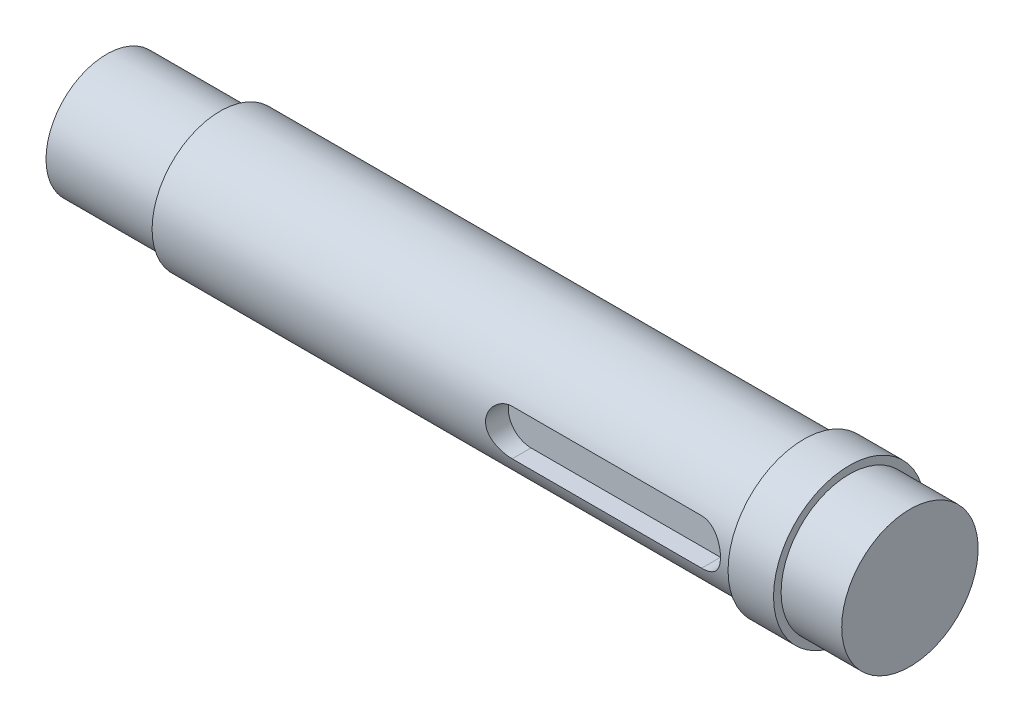
ISO-10303-21;
HEADER;
FILE_DESCRIPTION(('STEP AP214'),'2;1');
FILE_NAME('part.step','',(''),(''),'','','');
FILE_SCHEMA(('AUTOMOTIVE_DESIGN { 1 0 10303 214 1 1 1 1 }'));
ENDSEC;
DATA;
#1=APPLICATION_CONTEXT('core data for automotive mechanical design processes');
#2=APPLICATION_PROTOCOL_DEFINITION('international standard','automotive_design',2000,#1);
#3=PRODUCT_CONTEXT('',#1,'mechanical');
#4=PRODUCT('Part','Part','',(#3));
#5=PRODUCT_RELATED_PRODUCT_CATEGORY('part','',(#4));
#6=PRODUCT_DEFINITION_FORMATION('','',#4);
#7=PRODUCT_DEFINITION_CONTEXT('part definition',#1,'design');
#8=PRODUCT_DEFINITION('design','',#6,#7);
#9=PRODUCT_DEFINITION_SHAPE('','',#8);
#10=(LENGTH_UNIT() NAMED_UNIT(*) SI_UNIT(.MILLI.,.METRE.));
#11=(NAMED_UNIT(*) PLANE_ANGLE_UNIT() SI_UNIT($,.RADIAN.));
#12=(NAMED_UNIT(*) SI_UNIT($,.STERADIAN.) SOLID_ANGLE_UNIT());
#13=UNCERTAINTY_MEASURE_WITH_UNIT(LENGTH_MEASURE(1.E-05),#10,'distance_accuracy_value','');
#14=(GEOMETRIC_REPRESENTATION_CONTEXT(3) GLOBAL_UNCERTAINTY_ASSIGNED_CONTEXT((#13)) GLOBAL_UNIT_ASSIGNED_CONTEXT((#10,
#11,#12)) REPRESENTATION_CONTEXT('',''));
#15=CARTESIAN_POINT('',(0.,0.,0.));
#16=DIRECTION('',(0.,0.,1.));
#17=DIRECTION('',(1.,0.,0.));
#18=AXIS2_PLACEMENT_3D('',#15,#16,#17);
#19=CARTESIAN_POINT('',(0.,0.,0.));
#20=DIRECTION('',(1.,0.,0.));
#21=DIRECTION('',(0.,0.,-1.));
#22=AXIS2_PLACEMENT_3D('',#19,#20,#21);
#23=PLANE('',#22);
#24=CARTESIAN_POINT('',(0.,0.,0.));
#25=DIRECTION('',(-1.,0.,0.));
#26=DIRECTION('',(0.,0.,1.));
#27=AXIS2_PLACEMENT_3D('',#24,#25,#26);
#28=CIRCLE('',#27,8.);
#29=CARTESIAN_POINT('',(0.,0.,8.));
#30=VERTEX_POINT('',#29);
#31=EDGE_CURVE('E127',#30,#30,#28,.T.);
#32=ORIENTED_EDGE('',*,*,#31,.T.);
#33=EDGE_LOOP('',(#32));
#34=FACE_BOUND('',#33,.T.);
#35=ADVANCED_FACE('F38',(#34),#23,.F.);
#36=CARTESIAN_POINT('',(0.,0.,0.));
#37=DIRECTION('',(-1.,0.,0.));
#38=DIRECTION('',(0.,0.,1.));
#39=AXIS2_PLACEMENT_3D('',#36,#37,#38);
#40=CYLINDRICAL_SURFACE('',#39,8.);
#41=ORIENTED_EDGE('',*,*,#31,.F.);
#42=EDGE_LOOP('',(#41));
#43=FACE_BOUND('',#42,.T.);
#44=CARTESIAN_POINT('',(15.,0.,0.));
#45=DIRECTION('',(-1.,0.,0.));
#46=DIRECTION('',(0.,0.,1.));
#47=AXIS2_PLACEMENT_3D('',#44,#45,#46);
#48=CIRCLE('',#47,8.);
#49=CARTESIAN_POINT('',(15.,0.,8.));
#50=VERTEX_POINT('',#49);
#51=EDGE_CURVE('E124',#50,#50,#48,.T.);
#52=ORIENTED_EDGE('',*,*,#51,.T.);
#53=EDGE_LOOP('',(#52));
#54=FACE_BOUND('',#53,.T.);
#55=ADVANCED_FACE('F184',(#43,#54),#40,.T.);
#56=CARTESIAN_POINT('',(15.,0.,-9.));
#57=DIRECTION('',(1.,0.,0.));
#58=DIRECTION('',(0.,0.,-1.));
#59=AXIS2_PLACEMENT_3D('',#56,#57,#58);
#60=PLANE('',#59);
#61=ORIENTED_EDGE('',*,*,#51,.F.);
#62=EDGE_LOOP('',(#61));
#63=FACE_BOUND('',#62,.T.);
#64=CARTESIAN_POINT('',(15.,0.,0.));
#65=DIRECTION('',(-1.,0.,0.));
#66=DIRECTION('',(0.,0.,1.));
#67=AXIS2_PLACEMENT_3D('',#64,#65,#66);
#68=CIRCLE('',#67,9.);
#69=CARTESIAN_POINT('',(15.,0.,9.));
#70=VERTEX_POINT('',#69);
#71=EDGE_CURVE('E121',#70,#70,#68,.T.);
#72=ORIENTED_EDGE('',*,*,#71,.T.);
#73=EDGE_LOOP('',(#72));
#74=FACE_BOUND('',#73,.T.);
#75=ADVANCED_FACE('F179',(#63,#74),#60,.F.);
#76=CARTESIAN_POINT('',(0.,0.,0.));
#77=DIRECTION('',(-1.,0.,0.));
#78=DIRECTION('',(0.,0.,1.));
#79=AXIS2_PLACEMENT_3D('',#76,#77,#78);
#80=CYLINDRICAL_SURFACE('',#79,9.);
#81=DIRECTION('',(-1.,0.,0.));
#82=VECTOR('',#81,1.);
#83=CARTESIAN_POINT('',(0.,3.,8.48528137423857));
#84=LINE('',#83,#82);
#85=CARTESIAN_POINT('',(62.,3.,8.48528137423857));
#86=VERTEX_POINT('',#85);
#87=CARTESIAN_POINT('',(87.,3.,8.48528137423857));
#88=VERTEX_POINT('',#87);
#89=EDGE_CURVE('E11',#86,#88,#84,.F.);
#90=ORIENTED_EDGE('',*,*,#89,.T.);
#91=CARTESIAN_POINT('',(87.,3.,8.48528137423857));
#92=CARTESIAN_POINT('',(87.0818484933844,3.00001078932486,8.48526831927789));
#93=CARTESIAN_POINT('',(87.1636896896105,2.99665064665901,8.48646532685483));
#94=CARTESIAN_POINT('',(87.3267372460191,2.98327254936564,8.49118228945209));
#95=CARTESIAN_POINT('',(87.4079437715857,2.97325639196642,8.49470161740771));
#96=CARTESIAN_POINT('',(87.5689085860255,2.94668951307354,8.50395246303008));
#97=CARTESIAN_POINT('',(87.648670443061,2.93015817315762,8.50967741820142));
#98=CARTESIAN_POINT('',(87.8064099222994,2.89073017236145,8.52315143887203));
#99=CARTESIAN_POINT('',(87.884387479908,2.8678332814324,8.53090057752397));
#100=CARTESIAN_POINT('',(88.1147538956573,2.7898986156743,8.55683928952693));
#101=CARTESIAN_POINT('',(88.2638149889627,2.72557700172275,8.57773492660859));
#102=CARTESIAN_POINT('',(88.5490521737574,2.57421340927529,8.62436440905027));
#103=CARTESIAN_POINT('',(88.6852202829412,2.4871574792233,8.65010122261302));
#104=CARTESIAN_POINT('',(88.9461514841598,2.28915595016085,8.70463418867365));
#105=CARTESIAN_POINT('',(89.0703421713023,2.17747541556634,8.73350627313643));
#106=CARTESIAN_POINT('',(89.2986205239,1.93496485428979,8.79041552071283));
#107=CARTESIAN_POINT('',(89.402704609656,1.80413142497752,8.81845253440363));
#108=CARTESIAN_POINT('',(89.5904378690398,1.52281106991367,8.87141647315468));
#109=CARTESIAN_POINT('',(89.6734827690068,1.37190030336069,8.8962431223892));
#110=CARTESIAN_POINT('',(89.8127769392055,1.05728771462316,8.9390882626048));
#111=CARTESIAN_POINT('',(89.8690343949709,0.893589817668318,8.95710883299482));
#112=CARTESIAN_POINT('',(89.9512071304868,0.564088045229084,8.98377213313373));
#113=CARTESIAN_POINT('',(89.9781098013917,0.398555505085336,8.99271926928151));
#114=CARTESIAN_POINT('',(90.0039489118423,0.0650969066624176,9.0013082524901));
#115=CARTESIAN_POINT('',(90.0028920150987,-0.102828571762974,9.00095231678789));
#116=CARTESIAN_POINT('',(89.9734671340687,-0.42931153773399,8.99118115872284));
#117=CARTESIAN_POINT('',(89.9461720359939,-0.587978116884624,8.98212182877037));
#118=CARTESIAN_POINT('',(89.8668204541081,-0.898332184121464,8.9564088159923));
#119=CARTESIAN_POINT('',(89.8147625972955,-1.05001928471038,8.93975471206725));
#120=CARTESIAN_POINT('',(89.6867357048648,-1.34445790368094,8.90027004455731));
#121=CARTESIAN_POINT('',(89.6104611658558,-1.48706564697704,8.8773611217211));
#122=CARTESIAN_POINT('',(89.4364208447953,-1.75777363724201,8.82775164383326));
#123=CARTESIAN_POINT('',(89.3386492166759,-1.88586992347829,8.80105005807909));
#124=CARTESIAN_POINT('',(89.1189841175416,-2.13029252762403,8.74518810577395));
#125=CARTESIAN_POINT('',(88.9961729486756,-2.24578277403273,8.71597116015319));
#126=CARTESIAN_POINT('',(88.7326859547076,-2.4548141346411,8.65942491449435));
#127=CARTESIAN_POINT('',(88.5920043807076,-2.5483481578384,8.63209622629495));
#128=CARTESIAN_POINT('',(88.2939199217636,-2.71201733554396,8.58210018141277));
#129=CARTESIAN_POINT('',(88.1363008488814,-2.78178668333576,8.55950759277136));
#130=CARTESIAN_POINT('',(87.8923158654452,-2.86551808116445,8.5316849132946));
#131=CARTESIAN_POINT('',(87.8097432429298,-2.889939000529,8.52342263559069));
#132=CARTESIAN_POINT('',(87.6426296037896,-2.9316254907929,8.50917513666655));
#133=CARTESIAN_POINT('',(87.5580895046639,-2.94889432902108,8.50318887578236));
#134=CARTESIAN_POINT('',(87.3947667222494,-2.97496555991272,8.49410161473166));
#135=CARTESIAN_POINT('',(87.3160871393639,-2.98435073218189,8.49080270505212));
#136=CARTESIAN_POINT('',(87.1582744704951,-2.99686829404165,8.48638843638536));
#137=CARTESIAN_POINT('',(87.0791421023582,-3.0000087520931,8.48527025982562));
#138=CARTESIAN_POINT('',(87.,-3.,8.48528137423857));
#139=B_SPLINE_CURVE_WITH_KNOTS('',3,(#91,#92,#93,#94,#95,#96,#97,#98,#99,#100,#101,#102,#103,
#104,#105,#106,#107,#108,#109,#110,#111,#112,#113,#114,#115,#116,#117,#118,#119,#120,#121,#122,
#123,#124,#125,#126,#127,#128,#129,#130,#131,#132,#133,#134,#135,#136,#137,#138),.UNSPECIFIED.,
.F.,.F.,(4,2,2,2,2,2,2,2,2,2,2,2,2,2,2,2,2,2,2,2,2,2,2,4),(0.,0.245455454206294,
0.490844658508378,0.735509315314879,0.980182815366468,1.46881220307906,1.95774215958628,
2.46393436906068,2.97021661609276,3.48971320817339,4.00905095381417,4.51032334200243,
5.01147626109962,5.4929717741524,5.97449398742779,6.46234978495937,6.9503384178434,
7.46126084192186,7.97234804765762,8.49098011802154,8.75020549988895,9.0093123272696,
9.24695816264698,9.48429674853612),.UNSPECIFIED.);
#140=CARTESIAN_POINT('',(87.,-3.,8.48528137423857));
#141=VERTEX_POINT('',#140);
#142=EDGE_CURVE('E130',#88,#141,#139,.T.);
#143=ORIENTED_EDGE('',*,*,#142,.T.);
#144=DIRECTION('',(-1.,0.,0.));
#145=VECTOR('',#144,1.);
#146=CARTESIAN_POINT('',(0.,-3.,8.48528137423857));
#147=LINE('',#146,#145);
#148=CARTESIAN_POINT('',(62.,-3.,8.48528137423857));
#149=VERTEX_POINT('',#148);
#150=EDGE_CURVE('E45',#141,#149,#147,.T.);
#151=ORIENTED_EDGE('',*,*,#150,.T.);
#152=CARTESIAN_POINT('',(62.,-3.,8.48528137423857));
#153=CARTESIAN_POINT('',(61.9181515066156,-3.00001078932487,8.48526831927788));
#154=CARTESIAN_POINT('',(61.8363103103895,-2.99665064665902,8.48646532685483));
#155=CARTESIAN_POINT('',(61.6732627539809,-2.98327254936565,8.49118228945209));
#156=CARTESIAN_POINT('',(61.5920562284143,-2.97325639196643,8.49470161740771));
#157=CARTESIAN_POINT('',(61.4310914139745,-2.94668951307354,8.50395246303008));
#158=CARTESIAN_POINT('',(61.351329556939,-2.93015817315762,8.50967741820142));
#159=CARTESIAN_POINT('',(61.1935900777006,-2.89073017236145,8.52315143887203));
#160=CARTESIAN_POINT('',(61.115612520092,-2.86783328143241,8.53090057752397));
#161=CARTESIAN_POINT('',(60.8852461043427,-2.78989861567431,8.55683928952693));
#162=CARTESIAN_POINT('',(60.7361850110373,-2.72557700172276,8.57773492660859));
#163=CARTESIAN_POINT('',(60.4509478262426,-2.5742134092753,8.62436440905027));
#164=CARTESIAN_POINT('',(60.3147797170588,-2.48715747922331,8.65010122261301));
#165=CARTESIAN_POINT('',(60.0538485158402,-2.28915595016087,8.70463418867364));
#166=CARTESIAN_POINT('',(59.9296578286977,-2.17747541556635,8.73350627313642));
#167=CARTESIAN_POINT('',(59.7013794761,-1.93496485428979,8.79041552071283));
#168=CARTESIAN_POINT('',(59.597295390344,-1.80413142497752,8.81845253440362));
#169=CARTESIAN_POINT('',(59.4095621309602,-1.52281106991368,8.87141647315468));
#170=CARTESIAN_POINT('',(59.3265172309932,-1.37190030336069,8.8962431223892));
#171=CARTESIAN_POINT('',(59.1872230607945,-1.05728771462316,8.9390882626048));
#172=CARTESIAN_POINT('',(59.1309656050291,-0.893589817668323,8.95710883299482));
#173=CARTESIAN_POINT('',(59.0487928695132,-0.56408804522909,8.98377213313373));
#174=CARTESIAN_POINT('',(59.0218901986083,-0.398555505085342,8.99271926928151));
#175=CARTESIAN_POINT('',(58.9960510881577,-0.0650969066624229,9.0013082524901));
#176=CARTESIAN_POINT('',(58.9971079849012,0.102828571762969,9.00095231678788));
#177=CARTESIAN_POINT('',(59.0265328659313,0.429311537733985,8.99118115872284));
#178=CARTESIAN_POINT('',(59.0538279640061,0.587978116884617,8.98212182877037));
#179=CARTESIAN_POINT('',(59.1331795458919,0.898332184121457,8.9564088159923));
#180=CARTESIAN_POINT('',(59.1852374027045,1.05001928471038,8.93975471206725));
#181=CARTESIAN_POINT('',(59.3132642951352,1.34445790368094,8.90027004455731));
#182=CARTESIAN_POINT('',(59.3895388341442,1.48706564697703,8.87736112172109));
#183=CARTESIAN_POINT('',(59.5635791552047,1.757773637242,8.82775164383326));
#184=CARTESIAN_POINT('',(59.6613507833241,1.88586992347828,8.80105005807909));
#185=CARTESIAN_POINT('',(59.8810158824584,2.13029252762403,8.74518810577395));
#186=CARTESIAN_POINT('',(60.0038270513244,2.24578277403273,8.71597116015319));
#187=CARTESIAN_POINT('',(60.2673140452924,2.45481413464109,8.65942491449435));
#188=CARTESIAN_POINT('',(60.4079956192924,2.54834815783839,8.63209622629495));
#189=CARTESIAN_POINT('',(60.7060800782364,2.71201733554395,8.58210018141277));
#190=CARTESIAN_POINT('',(60.8636991511186,2.78178668333575,8.55950759277136));
#191=CARTESIAN_POINT('',(61.1076841345548,2.86551808116444,8.5316849132946));
#192=CARTESIAN_POINT('',(61.1902567570702,2.88993900052899,8.52342263559069));
#193=CARTESIAN_POINT('',(61.3573703962103,2.93162549079289,8.50917513666655));
#194=CARTESIAN_POINT('',(61.441910495336,2.94889432902107,8.50318887578236));
#195=CARTESIAN_POINT('',(61.6052332777506,2.97496555991272,8.49410161473166));
#196=CARTESIAN_POINT('',(61.6839128606361,2.98435073218189,8.49080270505212));
#197=CARTESIAN_POINT('',(61.8417255295049,2.99686829404165,8.48638843638536));
#198=CARTESIAN_POINT('',(61.9208578976418,3.00000875209309,8.48527025982562));
#199=CARTESIAN_POINT('',(62.,3.,8.48528137423857));
#200=B_SPLINE_CURVE_WITH_KNOTS('',3,(#152,#153,#154,#155,#156,#157,#158,#159,#160,#161,#162,
#163,#164,#165,#166,#167,#168,#169,#170,#171,#172,#173,#174,#175,#176,#177,#178,#179,#180,#181,
#182,#183,#184,#185,#186,#187,#188,#189,#190,#191,#192,#193,#194,#195,#196,#197,#198,#199),
.UNSPECIFIED.,.F.,.F.,(4,2,2,2,2,2,2,2,2,2,2,2,2,2,2,2,2,2,2,2,2,2,2,4),(0.,0.245455454206301,
0.490844658508393,0.735509315314893,0.980182815366468,1.46881220307906,1.95774215958628,
2.46393436906067,2.97021661609277,3.48971320817338,4.00905095381416,4.51032334200243,
5.01147626109962,5.4929717741524,5.97449398742778,6.46234978495938,6.9503384178434,
7.46126084192185,7.97234804765761,8.49098011802154,8.75020549988894,9.00931232726958,
9.24695816264694,9.48429674853609),.UNSPECIFIED.);
#201=EDGE_CURVE('E52',#149,#86,#200,.T.);
#202=ORIENTED_EDGE('',*,*,#201,.T.);
#203=EDGE_LOOP('',(#90,#143,#151,#202));
#204=FACE_BOUND('',#203,.T.);
#205=ORIENTED_EDGE('',*,*,#71,.F.);
#206=EDGE_LOOP('',(#205));
#207=FACE_BOUND('',#206,.T.);
#208=CARTESIAN_POINT('',(92.,0.,0.));
#209=DIRECTION('',(-1.,0.,0.));
#210=DIRECTION('',(0.,0.,1.));
#211=AXIS2_PLACEMENT_3D('',#208,#209,#210);
#212=CIRCLE('',#211,9.);
#213=CARTESIAN_POINT('',(92.,0.,9.));
#214=VERTEX_POINT('',#213);
#215=EDGE_CURVE('E118',#214,#214,#212,.T.);
#216=ORIENTED_EDGE('',*,*,#215,.T.);
#217=EDGE_LOOP('',(#216));
#218=FACE_BOUND('',#217,.T.);
#219=ADVANCED_FACE('F142',(#204,#207,#218),#80,.T.);
#220=CARTESIAN_POINT('',(92.,0.,-9.));
#221=DIRECTION('',(1.,0.,0.));
#222=DIRECTION('',(0.,0.,-1.));
#223=AXIS2_PLACEMENT_3D('',#220,#221,#222);
#224=PLANE('',#223);
#225=ORIENTED_EDGE('',*,*,#215,.F.);
#226=EDGE_LOOP('',(#225));
#227=FACE_BOUND('',#226,.T.);
#228=CARTESIAN_POINT('',(92.,0.,0.));
#229=DIRECTION('',(-1.,0.,0.));
#230=DIRECTION('',(0.,0.,1.));
#231=AXIS2_PLACEMENT_3D('',#228,#229,#230);
#232=CIRCLE('',#231,10.);
#233=CARTESIAN_POINT('',(92.,0.,10.));
#234=VERTEX_POINT('',#233);
#235=EDGE_CURVE('E115',#234,#234,#232,.T.);
#236=ORIENTED_EDGE('',*,*,#235,.T.);
#237=EDGE_LOOP('',(#236));
#238=FACE_BOUND('',#237,.T.);
#239=ADVANCED_FACE('F172',(#227,#238),#224,.F.);
#240=CARTESIAN_POINT('',(0.,0.,0.));
#241=DIRECTION('',(-1.,0.,0.));
#242=DIRECTION('',(0.,0.,1.));
#243=AXIS2_PLACEMENT_3D('',#240,#241,#242);
#244=CYLINDRICAL_SURFACE('',#243,10.);
#245=ORIENTED_EDGE('',*,*,#235,.F.);
#246=EDGE_LOOP('',(#245));
#247=FACE_BOUND('',#246,.T.);
#248=CARTESIAN_POINT('',(98.,0.,0.));
#249=DIRECTION('',(-1.,0.,0.));
#250=DIRECTION('',(0.,0.,1.));
#251=AXIS2_PLACEMENT_3D('',#248,#249,#250);
#252=CIRCLE('',#251,10.);
#253=CARTESIAN_POINT('',(98.,0.,10.));
#254=VERTEX_POINT('',#253);
#255=EDGE_CURVE('E112',#254,#254,#252,.T.);
#256=ORIENTED_EDGE('',*,*,#255,.T.);
#257=EDGE_LOOP('',(#256));
#258=FACE_BOUND('',#257,.T.);
#259=ADVANCED_FACE('F169',(#247,#258),#244,.T.);
#260=CARTESIAN_POINT('',(98.,0.,-10.));
#261=DIRECTION('',(-1.,0.,0.));
#262=DIRECTION('',(0.,0.,1.));
#263=AXIS2_PLACEMENT_3D('',#260,#261,#262);
#264=PLANE('',#263);
#265=ORIENTED_EDGE('',*,*,#255,.F.);
#266=EDGE_LOOP('',(#265));
#267=FACE_BOUND('',#266,.T.);
#268=CARTESIAN_POINT('',(98.,0.,0.));
#269=DIRECTION('',(-1.,0.,0.));
#270=DIRECTION('',(0.,0.,1.));
#271=AXIS2_PLACEMENT_3D('',#268,#269,#270);
#272=CIRCLE('',#271,9.);
#273=CARTESIAN_POINT('',(98.,0.,9.));
#274=VERTEX_POINT('',#273);
#275=EDGE_CURVE('E109',#274,#274,#272,.T.);
#276=ORIENTED_EDGE('',*,*,#275,.T.);
#277=EDGE_LOOP('',(#276));
#278=FACE_BOUND('',#277,.T.);
#279=ADVANCED_FACE('F165',(#267,#278),#264,.F.);
#280=CARTESIAN_POINT('',(0.,0.,0.));
#281=DIRECTION('',(-1.,0.,0.));
#282=DIRECTION('',(0.,0.,1.));
#283=AXIS2_PLACEMENT_3D('',#280,#281,#282);
#284=CYLINDRICAL_SURFACE('',#283,9.);
#285=ORIENTED_EDGE('',*,*,#275,.F.);
#286=EDGE_LOOP('',(#285));
#287=FACE_BOUND('',#286,.T.);
#288=CARTESIAN_POINT('',(106.,0.,0.));
#289=DIRECTION('',(-1.,0.,0.));
#290=DIRECTION('',(0.,0.,1.));
#291=AXIS2_PLACEMENT_3D('',#288,#289,#290);
#292=CIRCLE('',#291,9.);
#293=CARTESIAN_POINT('',(106.,0.,9.));
#294=VERTEX_POINT('',#293);
#295=EDGE_CURVE('E103',#294,#294,#292,.T.);
#296=ORIENTED_EDGE('',*,*,#295,.T.);
#297=EDGE_LOOP('',(#296));
#298=FACE_BOUND('',#297,.T.);
#299=ADVANCED_FACE('F161',(#287,#298),#284,.T.);
#300=CARTESIAN_POINT('',(106.,0.,-9.));
#301=DIRECTION('',(-1.,0.,0.));
#302=DIRECTION('',(0.,0.,1.));
#303=AXIS2_PLACEMENT_3D('',#300,#301,#302);
#304=PLANE('',#303);
#305=ORIENTED_EDGE('',*,*,#295,.F.);
#306=EDGE_LOOP('',(#305));
#307=FACE_BOUND('',#306,.T.);
#308=ADVANCED_FACE('F158',(#307),#304,.F.);
#309=CARTESIAN_POINT('',(62.,0.,6.));
#310=DIRECTION('',(0.,0.,1.));
#311=DIRECTION('',(1.,0.,0.));
#312=AXIS2_PLACEMENT_3D('',#309,#310,#311);
#313=CYLINDRICAL_SURFACE('',#312,3.);
#314=DIRECTION('',(0.,0.,1.));
#315=VECTOR('',#314,1.);
#316=CARTESIAN_POINT('',(62.,-3.,6.));
#317=LINE('',#316,#315);
#318=CARTESIAN_POINT('',(62.,-3.,6.));
#319=VERTEX_POINT('',#318);
#320=EDGE_CURVE('E75',#319,#149,#317,.T.);
#321=ORIENTED_EDGE('',*,*,#320,.F.);
#322=CARTESIAN_POINT('',(62.,0.,6.));
#323=DIRECTION('',(0.,0.,1.));
#324=DIRECTION('',(1.,0.,0.));
#325=AXIS2_PLACEMENT_3D('',#322,#323,#324);
#326=CIRCLE('',#325,3.);
#327=CARTESIAN_POINT('',(62.,3.,6.));
#328=VERTEX_POINT('',#327);
#329=EDGE_CURVE('E79',#328,#319,#326,.T.);
#330=ORIENTED_EDGE('',*,*,#329,.F.);
#331=DIRECTION('',(0.,0.,1.));
#332=VECTOR('',#331,1.);
#333=CARTESIAN_POINT('',(62.,3.,6.));
#334=LINE('',#333,#332);
#335=EDGE_CURVE('E101',#328,#86,#334,.T.);
#336=ORIENTED_EDGE('',*,*,#335,.T.);
#337=ORIENTED_EDGE('',*,*,#201,.F.);
#338=EDGE_LOOP('',(#321,#330,#336,#337));
#339=FACE_BOUND('',#338,.T.);
#340=ADVANCED_FACE('F77',(#339),#313,.F.);
#341=CARTESIAN_POINT('',(62.,3.,6.));
#342=DIRECTION('',(0.,1.,0.));
#343=DIRECTION('',(-1.,0.,0.));
#344=AXIS2_PLACEMENT_3D('',#341,#342,#343);
#345=PLANE('',#344);
#346=ORIENTED_EDGE('',*,*,#335,.F.);
#347=DIRECTION('',(-1.,0.,0.));
#348=VECTOR('',#347,1.);
#349=CARTESIAN_POINT('',(62.,3.,6.));
#350=LINE('',#349,#348);
#351=CARTESIAN_POINT('',(87.,3.,6.));
#352=VERTEX_POINT('',#351);
#353=EDGE_CURVE('E84',#352,#328,#350,.T.);
#354=ORIENTED_EDGE('',*,*,#353,.F.);
#355=DIRECTION('',(0.,0.,1.));
#356=VECTOR('',#355,1.);
#357=CARTESIAN_POINT('',(87.,3.,6.));
#358=LINE('',#357,#356);
#359=EDGE_CURVE('E104',#352,#88,#358,.T.);
#360=ORIENTED_EDGE('',*,*,#359,.T.);
#361=ORIENTED_EDGE('',*,*,#89,.F.);
#362=EDGE_LOOP('',(#346,#354,#360,#361));
#363=FACE_BOUND('',#362,.T.);
#364=ADVANCED_FACE('F151',(#363),#345,.F.);
#365=CARTESIAN_POINT('',(87.,0.,6.));
#366=DIRECTION('',(0.,0.,1.));
#367=DIRECTION('',(1.,0.,0.));
#368=AXIS2_PLACEMENT_3D('',#365,#366,#367);
#369=CYLINDRICAL_SURFACE('',#368,3.);
#370=ORIENTED_EDGE('',*,*,#359,.F.);
#371=CARTESIAN_POINT('',(87.,0.,6.));
#372=DIRECTION('',(0.,0.,1.));
#373=DIRECTION('',(1.,0.,0.));
#374=AXIS2_PLACEMENT_3D('',#371,#372,#373);
#375=CIRCLE('',#374,3.);
#376=CARTESIAN_POINT('',(87.,-3.,6.));
#377=VERTEX_POINT('',#376);
#378=EDGE_CURVE('E93',#377,#352,#375,.T.);
#379=ORIENTED_EDGE('',*,*,#378,.F.);
#380=DIRECTION('',(0.,0.,1.));
#381=VECTOR('',#380,1.);
#382=CARTESIAN_POINT('',(87.,-3.,6.));
#383=LINE('',#382,#381);
#384=EDGE_CURVE('E83',#377,#141,#383,.T.);
#385=ORIENTED_EDGE('',*,*,#384,.T.);
#386=ORIENTED_EDGE('',*,*,#142,.F.);
#387=EDGE_LOOP('',(#370,#379,#385,#386));
#388=FACE_BOUND('',#387,.T.);
#389=ADVANCED_FACE('F146',(#388),#369,.F.);
#390=CARTESIAN_POINT('',(62.,-3.,6.));
#391=DIRECTION('',(0.,-1.,0.));
#392=DIRECTION('',(1.,0.,0.));
#393=AXIS2_PLACEMENT_3D('',#390,#391,#392);
#394=PLANE('',#393);
#395=ORIENTED_EDGE('',*,*,#384,.F.);
#396=DIRECTION('',(1.,0.,0.));
#397=VECTOR('',#396,1.);
#398=CARTESIAN_POINT('',(62.,-3.,6.));
#399=LINE('',#398,#397);
#400=EDGE_CURVE('E87',#319,#377,#399,.T.);
#401=ORIENTED_EDGE('',*,*,#400,.F.);
#402=ORIENTED_EDGE('',*,*,#320,.T.);
#403=ORIENTED_EDGE('',*,*,#150,.F.);
#404=EDGE_LOOP('',(#395,#401,#402,#403));
#405=FACE_BOUND('',#404,.T.);
#406=ADVANCED_FACE('F88',(#405),#394,.F.);
#407=CARTESIAN_POINT('',(62.,0.,6.));
#408=DIRECTION('',(0.,0.,1.));
#409=DIRECTION('',(1.,0.,0.));
#410=AXIS2_PLACEMENT_3D('',#407,#408,#409);
#411=PLANE('',#410);
#412=ORIENTED_EDGE('',*,*,#329,.T.);
#413=ORIENTED_EDGE('',*,*,#400,.T.);
#414=ORIENTED_EDGE('',*,*,#378,.T.);
#415=ORIENTED_EDGE('',*,*,#353,.T.);
#416=EDGE_LOOP('',(#412,#413,#414,#415));
#417=FACE_BOUND('',#416,.T.);
#418=ADVANCED_FACE('F95',(#417),#411,.T.);
#419=CLOSED_SHELL('',(#35,#55,#75,#219,#239,#259,#279,#299,#308,#340,#364,#389,#406,#418));
#420=MANIFOLD_SOLID_BREP('B2',#419);
#421=ADVANCED_BREP_SHAPE_REPRESENTATION('',(#18,#420),#14);
#422=SHAPE_DEFINITION_REPRESENTATION(#9,#421);
ENDSEC;
END-ISO-10303-21;
